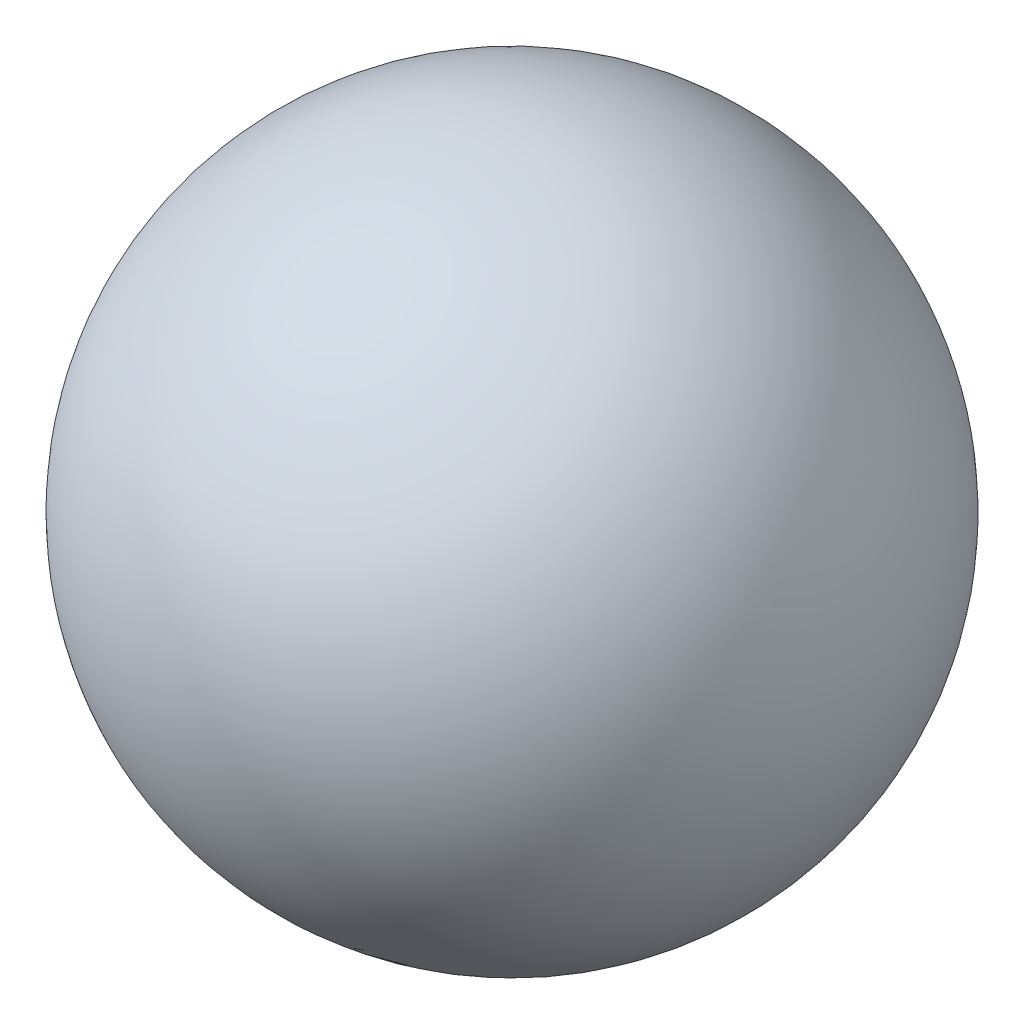
ISO-10303-21;
HEADER;
FILE_DESCRIPTION(('STEP AP214'),'2;1');
FILE_NAME('part.step','',(''),(''),'','','');
FILE_SCHEMA(('AUTOMOTIVE_DESIGN { 1 0 10303 214 1 1 1 1 }'));
ENDSEC;
DATA;
#1=APPLICATION_CONTEXT('core data for automotive mechanical design processes');
#2=APPLICATION_PROTOCOL_DEFINITION('international standard','automotive_design',2000,#1);
#3=PRODUCT_CONTEXT('',#1,'mechanical');
#4=PRODUCT('Part','Part','',(#3));
#5=PRODUCT_RELATED_PRODUCT_CATEGORY('part','',(#4));
#6=PRODUCT_DEFINITION_FORMATION('','',#4);
#7=PRODUCT_DEFINITION_CONTEXT('part definition',#1,'design');
#8=PRODUCT_DEFINITION('design','',#6,#7);
#9=PRODUCT_DEFINITION_SHAPE('','',#8);
#10=(LENGTH_UNIT() NAMED_UNIT(*) SI_UNIT(.MILLI.,.METRE.));
#11=(NAMED_UNIT(*) PLANE_ANGLE_UNIT() SI_UNIT($,.RADIAN.));
#12=(NAMED_UNIT(*) SI_UNIT($,.STERADIAN.) SOLID_ANGLE_UNIT());
#13=UNCERTAINTY_MEASURE_WITH_UNIT(LENGTH_MEASURE(1.E-05),#10,'distance_accuracy_value','');
#14=(GEOMETRIC_REPRESENTATION_CONTEXT(3) GLOBAL_UNCERTAINTY_ASSIGNED_CONTEXT((#13)) GLOBAL_UNIT_ASSIGNED_CONTEXT((#10,
#11,#12)) REPRESENTATION_CONTEXT('',''));
#15=CARTESIAN_POINT('',(0.,0.,0.));
#16=DIRECTION('',(0.,0.,1.));
#17=DIRECTION('',(1.,0.,0.));
#18=AXIS2_PLACEMENT_3D('',#15,#16,#17);
#19=CARTESIAN_POINT('',(67.76,8.84293024895821,68.7813807717035));
#20=DIRECTION('',(0.,0.127516208211661,0.99183648684817));
#21=DIRECTION('',(0.173648177666933,-0.976768261968468,0.125578950481563));
#22=AXIS2_PLACEMENT_3D('',#19,#20,#21);
#23=SPHERICAL_SURFACE('',#22,7.15);
#24=CARTESIAN_POINT('',(67.76,9.75467113767159,75.8730116526679));
#25=VERTEX_POINT('',#24);
#26=VERTEX_LOOP('',#25);
#27=FACE_BOUND('',#26,.T.);
#28=CARTESIAN_POINT('',(67.76,7.93118936024483,61.6897498907391));
#29=VERTEX_POINT('',#28);
#30=VERTEX_LOOP('',#29);
#31=FACE_BOUND('',#30,.T.);
#32=ADVANCED_FACE('F16',(#27,#31),#23,.T.);
#33=CLOSED_SHELL('',(#32));
#34=MANIFOLD_SOLID_BREP('B1',#33);
#35=ADVANCED_BREP_SHAPE_REPRESENTATION('',(#18,#34),#14);
#36=SHAPE_DEFINITION_REPRESENTATION(#9,#35);
ENDSEC;
END-ISO-10303-21;
